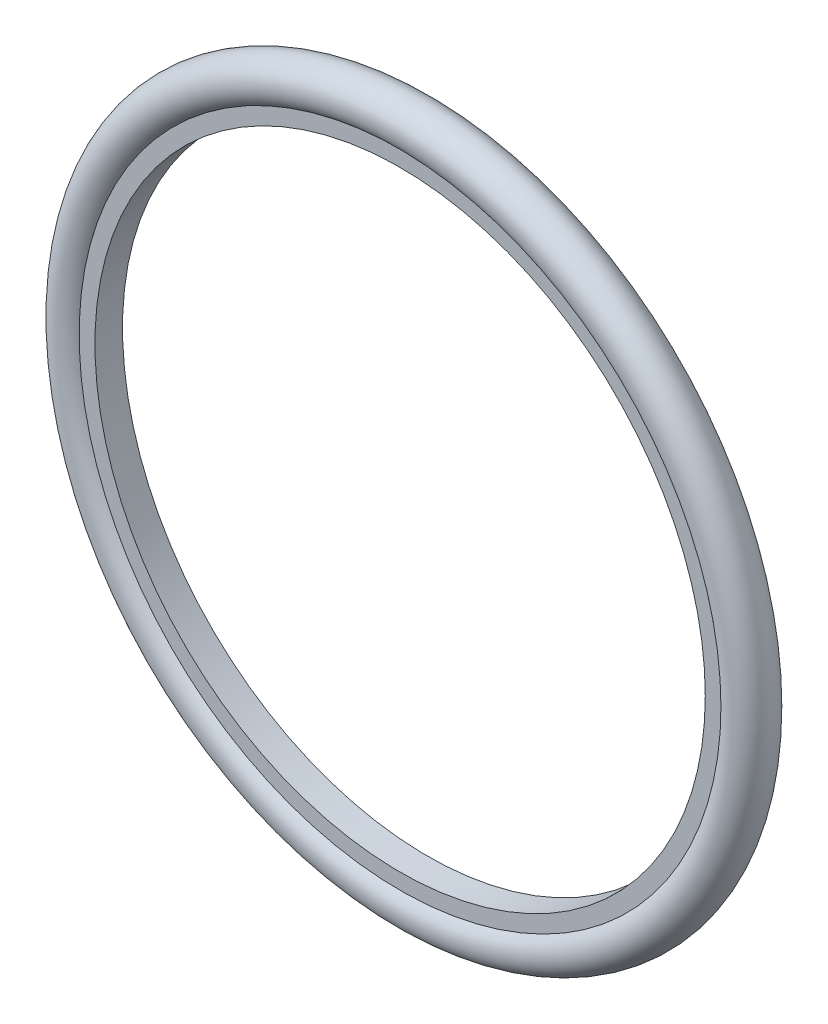
ISO-10303-21;
HEADER;
FILE_DESCRIPTION(('STEP AP214'),'2;1');
FILE_NAME('part.step','',(''),(''),'','','');
FILE_SCHEMA(('AUTOMOTIVE_DESIGN { 1 0 10303 214 1 1 1 1 }'));
ENDSEC;
DATA;
#1=APPLICATION_CONTEXT('core data for automotive mechanical design processes');
#2=APPLICATION_PROTOCOL_DEFINITION('international standard','automotive_design',2000,#1);
#3=PRODUCT_CONTEXT('',#1,'mechanical');
#4=PRODUCT('Part','Part','',(#3));
#5=PRODUCT_RELATED_PRODUCT_CATEGORY('part','',(#4));
#6=PRODUCT_DEFINITION_FORMATION('','',#4);
#7=PRODUCT_DEFINITION_CONTEXT('part definition',#1,'design');
#8=PRODUCT_DEFINITION('design','',#6,#7);
#9=PRODUCT_DEFINITION_SHAPE('','',#8);
#10=(LENGTH_UNIT() NAMED_UNIT(*) SI_UNIT(.MILLI.,.METRE.));
#11=(NAMED_UNIT(*) PLANE_ANGLE_UNIT() SI_UNIT($,.RADIAN.));
#12=(NAMED_UNIT(*) SI_UNIT($,.STERADIAN.) SOLID_ANGLE_UNIT());
#13=UNCERTAINTY_MEASURE_WITH_UNIT(LENGTH_MEASURE(1.E-05),#10,'distance_accuracy_value','');
#14=(GEOMETRIC_REPRESENTATION_CONTEXT(3) GLOBAL_UNCERTAINTY_ASSIGNED_CONTEXT((#13)) GLOBAL_UNIT_ASSIGNED_CONTEXT((#10,
#11,#12)) REPRESENTATION_CONTEXT('',''));
#15=CARTESIAN_POINT('',(0.,0.,0.));
#16=DIRECTION('',(0.,0.,1.));
#17=DIRECTION('',(1.,0.,0.));
#18=AXIS2_PLACEMENT_3D('',#15,#16,#17);
#19=CARTESIAN_POINT('',(0.,0.,0.));
#20=DIRECTION('',(0.,0.,1.));
#21=DIRECTION('',(1.,0.,0.));
#22=AXIS2_PLACEMENT_3D('',#19,#20,#21);
#23=TOROIDAL_SURFACE('',#22,298.45,19.05);
#24=CARTESIAN_POINT('',(0.,0.,12.192));
#25=DIRECTION('',(0.,0.,1.));
#26=DIRECTION('',(1.,0.,0.));
#27=AXIS2_PLACEMENT_3D('',#24,#25,#26);
#28=CIRCLE('',#27,283.812457993229);
#29=CARTESIAN_POINT('',(283.812457993229,0.,12.192));
#30=VERTEX_POINT('',#29);
#31=EDGE_CURVE('E10',#30,#30,#28,.T.);
#32=ORIENTED_EDGE('',*,*,#31,.F.);
#33=EDGE_LOOP('',(#32));
#34=FACE_BOUND('',#33,.T.);
#35=CARTESIAN_POINT('',(0.,0.,-12.192));
#36=DIRECTION('',(0.,0.,1.));
#37=DIRECTION('',(1.,0.,0.));
#38=AXIS2_PLACEMENT_3D('',#35,#36,#37);
#39=CIRCLE('',#38,283.812457993229);
#40=CARTESIAN_POINT('',(283.812457993229,0.,-12.192));
#41=VERTEX_POINT('',#40);
#42=EDGE_CURVE('E64',#41,#41,#39,.T.);
#43=ORIENTED_EDGE('',*,*,#42,.T.);
#44=EDGE_LOOP('',(#43));
#45=FACE_BOUND('',#44,.T.);
#46=ADVANCED_FACE('F43',(#34,#45),#23,.T.);
#47=CARTESIAN_POINT('',(0.,269.875,12.192));
#48=DIRECTION('',(0.,0.,-1.));
#49=DIRECTION('',(-1.,0.,0.));
#50=AXIS2_PLACEMENT_3D('',#47,#48,#49);
#51=PLANE('',#50);
#52=CARTESIAN_POINT('',(0.,0.,12.192));
#53=DIRECTION('',(0.,0.,1.));
#54=DIRECTION('',(1.,0.,0.));
#55=AXIS2_PLACEMENT_3D('',#52,#53,#54);
#56=CIRCLE('',#55,269.875);
#57=CARTESIAN_POINT('',(269.875,0.,12.192));
#58=VERTEX_POINT('',#57);
#59=EDGE_CURVE('E50',#58,#58,#56,.T.);
#60=ORIENTED_EDGE('',*,*,#59,.F.);
#61=EDGE_LOOP('',(#60));
#62=FACE_BOUND('',#61,.T.);
#63=ORIENTED_EDGE('',*,*,#31,.T.);
#64=EDGE_LOOP('',(#63));
#65=FACE_BOUND('',#64,.T.);
#66=ADVANCED_FACE('F82',(#62,#65),#51,.F.);
#67=CARTESIAN_POINT('',(0.,0.,0.));
#68=DIRECTION('',(0.,0.,1.));
#69=DIRECTION('',(1.,0.,0.));
#70=AXIS2_PLACEMENT_3D('',#67,#68,#69);
#71=CYLINDRICAL_SURFACE('',#70,269.875);
#72=CARTESIAN_POINT('',(0.,0.,-12.192));
#73=DIRECTION('',(0.,0.,1.));
#74=DIRECTION('',(1.,0.,0.));
#75=AXIS2_PLACEMENT_3D('',#72,#73,#74);
#76=CIRCLE('',#75,269.875);
#77=CARTESIAN_POINT('',(269.875,0.,-12.192));
#78=VERTEX_POINT('',#77);
#79=EDGE_CURVE('E57',#78,#78,#76,.T.);
#80=ORIENTED_EDGE('',*,*,#79,.F.);
#81=EDGE_LOOP('',(#80));
#82=FACE_BOUND('',#81,.T.);
#83=ORIENTED_EDGE('',*,*,#59,.T.);
#84=EDGE_LOOP('',(#83));
#85=FACE_BOUND('',#84,.T.);
#86=ADVANCED_FACE('F77',(#82,#85),#71,.F.);
#87=CARTESIAN_POINT('',(0.,269.875,-12.192));
#88=DIRECTION('',(0.,0.,1.));
#89=DIRECTION('',(1.,0.,0.));
#90=AXIS2_PLACEMENT_3D('',#87,#88,#89);
#91=PLANE('',#90);
#92=ORIENTED_EDGE('',*,*,#42,.F.);
#93=EDGE_LOOP('',(#92));
#94=FACE_BOUND('',#93,.T.);
#95=ORIENTED_EDGE('',*,*,#79,.T.);
#96=EDGE_LOOP('',(#95));
#97=FACE_BOUND('',#96,.T.);
#98=ADVANCED_FACE('F74',(#94,#97),#91,.F.);
#99=CLOSED_SHELL('',(#46,#66,#86,#98));
#100=MANIFOLD_SOLID_BREP('B2',#99);
#101=ADVANCED_BREP_SHAPE_REPRESENTATION('',(#18,#100),#14);
#102=SHAPE_DEFINITION_REPRESENTATION(#9,#101);
ENDSEC;
END-ISO-10303-21;
